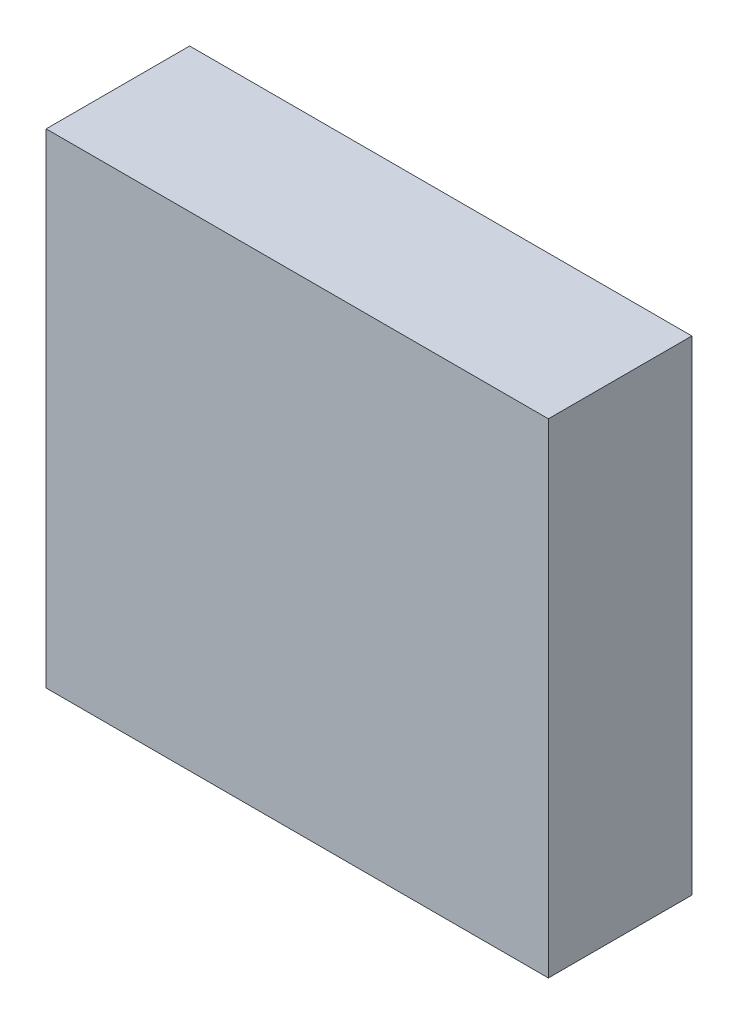
ISO-10303-21;
HEADER;
FILE_DESCRIPTION(('STEP AP214'),'2;1');
FILE_NAME('part.step','',(''),(''),'','','');
FILE_SCHEMA(('AUTOMOTIVE_DESIGN { 1 0 10303 214 1 1 1 1 }'));
ENDSEC;
DATA;
#1=APPLICATION_CONTEXT('core data for automotive mechanical design processes');
#2=APPLICATION_PROTOCOL_DEFINITION('international standard','automotive_design',2000,#1);
#3=PRODUCT_CONTEXT('',#1,'mechanical');
#4=PRODUCT('Part','Part','',(#3));
#5=PRODUCT_RELATED_PRODUCT_CATEGORY('part','',(#4));
#6=PRODUCT_DEFINITION_FORMATION('','',#4);
#7=PRODUCT_DEFINITION_CONTEXT('part definition',#1,'design');
#8=PRODUCT_DEFINITION('design','',#6,#7);
#9=PRODUCT_DEFINITION_SHAPE('','',#8);
#10=(LENGTH_UNIT() NAMED_UNIT(*) SI_UNIT(.MILLI.,.METRE.));
#11=(NAMED_UNIT(*) PLANE_ANGLE_UNIT() SI_UNIT($,.RADIAN.));
#12=(NAMED_UNIT(*) SI_UNIT($,.STERADIAN.) SOLID_ANGLE_UNIT());
#13=UNCERTAINTY_MEASURE_WITH_UNIT(LENGTH_MEASURE(1.E-05),#10,'distance_accuracy_value','');
#14=(GEOMETRIC_REPRESENTATION_CONTEXT(3) GLOBAL_UNCERTAINTY_ASSIGNED_CONTEXT((#13)) GLOBAL_UNIT_ASSIGNED_CONTEXT((#10,
#11,#12)) REPRESENTATION_CONTEXT('',''));
#15=CARTESIAN_POINT('',(0.,0.,0.));
#16=DIRECTION('',(0.,0.,1.));
#17=DIRECTION('',(1.,0.,0.));
#18=AXIS2_PLACEMENT_3D('',#15,#16,#17);
#19=CARTESIAN_POINT('',(0.,0.,8.));
#20=DIRECTION('',(-1.,0.,0.));
#21=DIRECTION('',(0.,-1.,0.));
#22=AXIS2_PLACEMENT_3D('',#19,#20,#21);
#23=PLANE('',#22);
#24=DIRECTION('',(0.,1.,0.));
#25=VECTOR('',#24,1.);
#26=CARTESIAN_POINT('',(0.,0.,0.));
#27=LINE('',#26,#25);
#28=CARTESIAN_POINT('',(0.,-27.,0.));
#29=VERTEX_POINT('',#28);
#30=CARTESIAN_POINT('',(0.,0.,0.));
#31=VERTEX_POINT('',#30);
#32=EDGE_CURVE('E98',#29,#31,#27,.T.);
#33=ORIENTED_EDGE('',*,*,#32,.T.);
#34=DIRECTION('',(0.,0.,-1.));
#35=VECTOR('',#34,1.);
#36=CARTESIAN_POINT('',(0.,0.,8.));
#37=LINE('',#36,#35);
#38=CARTESIAN_POINT('',(0.,0.,8.));
#39=VERTEX_POINT('',#38);
#40=EDGE_CURVE('E11',#39,#31,#37,.T.);
#41=ORIENTED_EDGE('',*,*,#40,.F.);
#42=DIRECTION('',(0.,1.,0.));
#43=VECTOR('',#42,1.);
#44=CARTESIAN_POINT('',(0.,0.,8.));
#45=LINE('',#44,#43);
#46=CARTESIAN_POINT('',(0.,-27.,8.));
#47=VERTEX_POINT('',#46);
#48=EDGE_CURVE('E86',#47,#39,#45,.T.);
#49=ORIENTED_EDGE('',*,*,#48,.F.);
#50=DIRECTION('',(0.,0.,-1.));
#51=VECTOR('',#50,1.);
#52=CARTESIAN_POINT('',(0.,-27.,8.));
#53=LINE('',#52,#51);
#54=EDGE_CURVE('E94',#47,#29,#53,.T.);
#55=ORIENTED_EDGE('',*,*,#54,.T.);
#56=EDGE_LOOP('',(#33,#41,#49,#55));
#57=FACE_BOUND('',#56,.T.);
#58=ADVANCED_FACE('F35',(#57),#23,.F.);
#59=CARTESIAN_POINT('',(0.,0.,8.));
#60=DIRECTION('',(0.,-1.,0.));
#61=DIRECTION('',(0.,0.,-1.));
#62=AXIS2_PLACEMENT_3D('',#59,#60,#61);
#63=PLANE('',#62);
#64=DIRECTION('',(-1.,0.,0.));
#65=VECTOR('',#64,1.);
#66=CARTESIAN_POINT('',(0.,0.,0.));
#67=LINE('',#66,#65);
#68=CARTESIAN_POINT('',(-28.,0.,0.));
#69=VERTEX_POINT('',#68);
#70=EDGE_CURVE('E90',#31,#69,#67,.T.);
#71=ORIENTED_EDGE('',*,*,#70,.T.);
#72=DIRECTION('',(0.,0.,-1.));
#73=VECTOR('',#72,1.);
#74=CARTESIAN_POINT('',(-28.,0.,8.));
#75=LINE('',#74,#73);
#76=CARTESIAN_POINT('',(-28.,0.,8.));
#77=VERTEX_POINT('',#76);
#78=EDGE_CURVE('E43',#77,#69,#75,.T.);
#79=ORIENTED_EDGE('',*,*,#78,.F.);
#80=DIRECTION('',(-1.,0.,0.));
#81=VECTOR('',#80,1.);
#82=CARTESIAN_POINT('',(0.,0.,8.));
#83=LINE('',#82,#81);
#84=EDGE_CURVE('E81',#39,#77,#83,.T.);
#85=ORIENTED_EDGE('',*,*,#84,.F.);
#86=ORIENTED_EDGE('',*,*,#40,.T.);
#87=EDGE_LOOP('',(#71,#79,#85,#86));
#88=FACE_BOUND('',#87,.T.);
#89=ADVANCED_FACE('F89',(#88),#63,.F.);
#90=CARTESIAN_POINT('',(-28.,0.,8.));
#91=DIRECTION('',(1.,0.,0.));
#92=DIRECTION('',(0.,0.,-1.));
#93=AXIS2_PLACEMENT_3D('',#90,#91,#92);
#94=PLANE('',#93);
#95=DIRECTION('',(0.,-1.,0.));
#96=VECTOR('',#95,1.);
#97=CARTESIAN_POINT('',(-28.,0.,0.));
#98=LINE('',#97,#96);
#99=CARTESIAN_POINT('',(-28.,-27.,0.));
#100=VERTEX_POINT('',#99);
#101=EDGE_CURVE('E68',#69,#100,#98,.T.);
#102=ORIENTED_EDGE('',*,*,#101,.T.);
#103=DIRECTION('',(0.,0.,-1.));
#104=VECTOR('',#103,1.);
#105=CARTESIAN_POINT('',(-28.,-27.,8.));
#106=LINE('',#105,#104);
#107=CARTESIAN_POINT('',(-28.,-27.,8.));
#108=VERTEX_POINT('',#107);
#109=EDGE_CURVE('E91',#108,#100,#106,.T.);
#110=ORIENTED_EDGE('',*,*,#109,.F.);
#111=DIRECTION('',(0.,-1.,0.));
#112=VECTOR('',#111,1.);
#113=CARTESIAN_POINT('',(-28.,0.,8.));
#114=LINE('',#113,#112);
#115=EDGE_CURVE('E84',#77,#108,#114,.T.);
#116=ORIENTED_EDGE('',*,*,#115,.F.);
#117=ORIENTED_EDGE('',*,*,#78,.T.);
#118=EDGE_LOOP('',(#102,#110,#116,#117));
#119=FACE_BOUND('',#118,.T.);
#120=ADVANCED_FACE('F92',(#119),#94,.F.);
#121=CARTESIAN_POINT('',(0.,-27.,8.));
#122=DIRECTION('',(0.,1.,0.));
#123=DIRECTION('',(-1.,0.,0.));
#124=AXIS2_PLACEMENT_3D('',#121,#122,#123);
#125=PLANE('',#124);
#126=DIRECTION('',(1.,0.,0.));
#127=VECTOR('',#126,1.);
#128=CARTESIAN_POINT('',(0.,-27.,0.));
#129=LINE('',#128,#127);
#130=EDGE_CURVE('E74',#100,#29,#129,.T.);
#131=ORIENTED_EDGE('',*,*,#130,.T.);
#132=ORIENTED_EDGE('',*,*,#54,.F.);
#133=DIRECTION('',(1.,0.,0.));
#134=VECTOR('',#133,1.);
#135=CARTESIAN_POINT('',(0.,-27.,8.));
#136=LINE('',#135,#134);
#137=EDGE_CURVE('E51',#108,#47,#136,.T.);
#138=ORIENTED_EDGE('',*,*,#137,.F.);
#139=ORIENTED_EDGE('',*,*,#109,.T.);
#140=EDGE_LOOP('',(#131,#132,#138,#139));
#141=FACE_BOUND('',#140,.T.);
#142=ADVANCED_FACE('F105',(#141),#125,.F.);
#143=CARTESIAN_POINT('',(0.,0.,8.));
#144=DIRECTION('',(0.,0.,-1.));
#145=DIRECTION('',(-1.,0.,0.));
#146=AXIS2_PLACEMENT_3D('',#143,#144,#145);
#147=PLANE('',#146);
#148=ORIENTED_EDGE('',*,*,#48,.T.);
#149=ORIENTED_EDGE('',*,*,#84,.T.);
#150=ORIENTED_EDGE('',*,*,#115,.T.);
#151=ORIENTED_EDGE('',*,*,#137,.T.);
#152=EDGE_LOOP('',(#148,#149,#150,#151));
#153=FACE_BOUND('',#152,.T.);
#154=ADVANCED_FACE('F82',(#153),#147,.F.);
#155=CARTESIAN_POINT('',(0.,0.,0.));
#156=DIRECTION('',(0.,0.,-1.));
#157=DIRECTION('',(-1.,0.,0.));
#158=AXIS2_PLACEMENT_3D('',#155,#156,#157);
#159=PLANE('',#158);
#160=ORIENTED_EDGE('',*,*,#32,.F.);
#161=ORIENTED_EDGE('',*,*,#130,.F.);
#162=ORIENTED_EDGE('',*,*,#101,.F.);
#163=ORIENTED_EDGE('',*,*,#70,.F.);
#164=EDGE_LOOP('',(#160,#161,#162,#163));
#165=FACE_BOUND('',#164,.T.);
#166=ADVANCED_FACE('F108',(#165),#159,.T.);
#167=CLOSED_SHELL('',(#58,#89,#120,#142,#154,#166));
#168=MANIFOLD_SOLID_BREP('B2',#167);
#169=ADVANCED_BREP_SHAPE_REPRESENTATION('',(#18,#168),#14);
#170=SHAPE_DEFINITION_REPRESENTATION(#9,#169);
ENDSEC;
END-ISO-10303-21;
